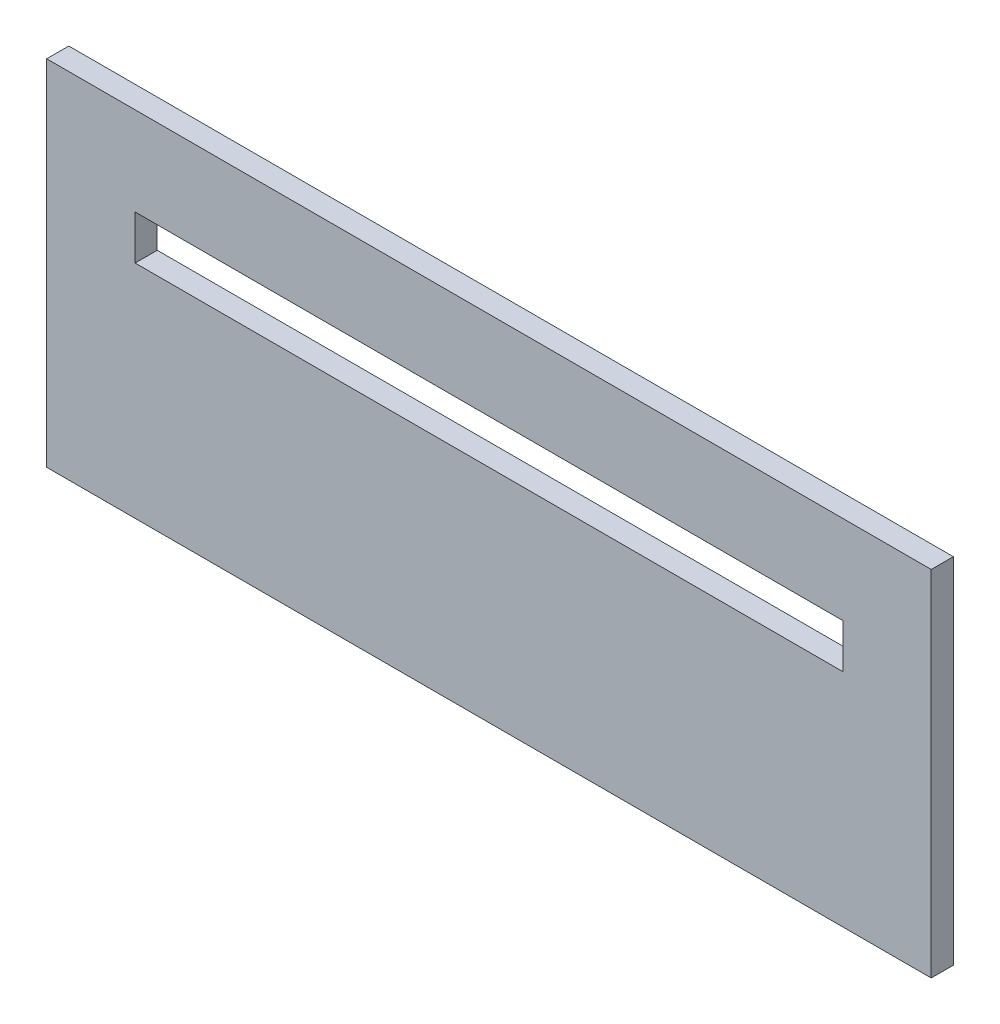
ISO-10303-21;
HEADER;
FILE_DESCRIPTION(('STEP AP214'),'2;1');
FILE_NAME('part.step','',(''),(''),'','','');
FILE_SCHEMA(('AUTOMOTIVE_DESIGN { 1 0 10303 214 1 1 1 1 }'));
ENDSEC;
DATA;
#1=APPLICATION_CONTEXT('core data for automotive mechanical design processes');
#2=APPLICATION_PROTOCOL_DEFINITION('international standard','automotive_design',2000,#1);
#3=PRODUCT_CONTEXT('',#1,'mechanical');
#4=PRODUCT('Part','Part','',(#3));
#5=PRODUCT_RELATED_PRODUCT_CATEGORY('part','',(#4));
#6=PRODUCT_DEFINITION_FORMATION('','',#4);
#7=PRODUCT_DEFINITION_CONTEXT('part definition',#1,'design');
#8=PRODUCT_DEFINITION('design','',#6,#7);
#9=PRODUCT_DEFINITION_SHAPE('','',#8);
#10=(LENGTH_UNIT() NAMED_UNIT(*) SI_UNIT(.MILLI.,.METRE.));
#11=(NAMED_UNIT(*) PLANE_ANGLE_UNIT() SI_UNIT($,.RADIAN.));
#12=(NAMED_UNIT(*) SI_UNIT($,.STERADIAN.) SOLID_ANGLE_UNIT());
#13=UNCERTAINTY_MEASURE_WITH_UNIT(LENGTH_MEASURE(1.E-05),#10,'distance_accuracy_value','');
#14=(GEOMETRIC_REPRESENTATION_CONTEXT(3) GLOBAL_UNCERTAINTY_ASSIGNED_CONTEXT((#13)) GLOBAL_UNIT_ASSIGNED_CONTEXT((#10,
#11,#12)) REPRESENTATION_CONTEXT('',''));
#15=CARTESIAN_POINT('',(0.,0.,0.));
#16=DIRECTION('',(0.,0.,1.));
#17=DIRECTION('',(1.,0.,0.));
#18=AXIS2_PLACEMENT_3D('',#15,#16,#17);
#19=CARTESIAN_POINT('',(97.9550407371005,41.8692483925575,3.175));
#20=DIRECTION('',(-1.,0.,0.));
#21=DIRECTION('',(0.,-1.,0.));
#22=AXIS2_PLACEMENT_3D('',#19,#20,#21);
#23=PLANE('',#22);
#24=DIRECTION('',(0.,1.,0.));
#25=VECTOR('',#24,1.);
#26=CARTESIAN_POINT('',(97.9550407371005,41.8692483925575,0.));
#27=LINE('',#26,#25);
#28=CARTESIAN_POINT('',(97.9550407371005,-8.93075160744255,0.));
#29=VERTEX_POINT('',#28);
#30=CARTESIAN_POINT('',(97.9550407371005,41.8692483925575,0.));
#31=VERTEX_POINT('',#30);
#32=EDGE_CURVE('E130',#29,#31,#27,.T.);
#33=ORIENTED_EDGE('',*,*,#32,.T.);
#34=DIRECTION('',(0.,0.,-1.));
#35=VECTOR('',#34,1.);
#36=CARTESIAN_POINT('',(97.9550407371005,41.8692483925575,3.175));
#37=LINE('',#36,#35);
#38=CARTESIAN_POINT('',(97.9550407371005,41.8692483925575,3.175));
#39=VERTEX_POINT('',#38);
#40=EDGE_CURVE('E11',#39,#31,#37,.T.);
#41=ORIENTED_EDGE('',*,*,#40,.F.);
#42=DIRECTION('',(0.,1.,0.));
#43=VECTOR('',#42,1.);
#44=CARTESIAN_POINT('',(97.9550407371005,41.8692483925575,3.175));
#45=LINE('',#44,#43);
#46=CARTESIAN_POINT('',(97.9550407371005,-8.93075160744255,3.175));
#47=VERTEX_POINT('',#46);
#48=EDGE_CURVE('E134',#47,#39,#45,.T.);
#49=ORIENTED_EDGE('',*,*,#48,.F.);
#50=DIRECTION('',(0.,0.,-1.));
#51=VECTOR('',#50,1.);
#52=CARTESIAN_POINT('',(97.9550407371005,-8.93075160744255,3.175));
#53=LINE('',#52,#51);
#54=EDGE_CURVE('E144',#47,#29,#53,.T.);
#55=ORIENTED_EDGE('',*,*,#54,.T.);
#56=EDGE_LOOP('',(#33,#41,#49,#55));
#57=FACE_BOUND('',#56,.T.);
#58=ADVANCED_FACE('F33',(#57),#23,.F.);
#59=CARTESIAN_POINT('',(97.9550407371005,41.8692483925575,3.175));
#60=DIRECTION('',(0.,-1.,0.));
#61=DIRECTION('',(1.,0.,0.));
#62=AXIS2_PLACEMENT_3D('',#59,#60,#61);
#63=PLANE('',#62);
#64=DIRECTION('',(-1.,0.,0.));
#65=VECTOR('',#64,1.);
#66=CARTESIAN_POINT('',(97.9550407371005,41.8692483925575,0.));
#67=LINE('',#66,#65);
#68=CARTESIAN_POINT('',(-29.0449592628995,41.8692483925574,0.));
#69=VERTEX_POINT('',#68);
#70=EDGE_CURVE('E147',#31,#69,#67,.T.);
#71=ORIENTED_EDGE('',*,*,#70,.T.);
#72=DIRECTION('',(0.,0.,-1.));
#73=VECTOR('',#72,1.);
#74=CARTESIAN_POINT('',(-29.0449592628995,41.8692483925574,3.175));
#75=LINE('',#74,#73);
#76=CARTESIAN_POINT('',(-29.0449592628995,41.8692483925574,3.175));
#77=VERTEX_POINT('',#76);
#78=EDGE_CURVE('E40',#77,#69,#75,.T.);
#79=ORIENTED_EDGE('',*,*,#78,.F.);
#80=DIRECTION('',(-1.,0.,0.));
#81=VECTOR('',#80,1.);
#82=CARTESIAN_POINT('',(97.9550407371005,41.8692483925575,3.175));
#83=LINE('',#82,#81);
#84=EDGE_CURVE('E137',#39,#77,#83,.T.);
#85=ORIENTED_EDGE('',*,*,#84,.F.);
#86=ORIENTED_EDGE('',*,*,#40,.T.);
#87=EDGE_LOOP('',(#71,#79,#85,#86));
#88=FACE_BOUND('',#87,.T.);
#89=ADVANCED_FACE('F175',(#88),#63,.F.);
#90=CARTESIAN_POINT('',(-29.0449592628995,41.8692483925574,3.175));
#91=DIRECTION('',(1.,0.,0.));
#92=DIRECTION('',(0.,1.,0.));
#93=AXIS2_PLACEMENT_3D('',#90,#91,#92);
#94=PLANE('',#93);
#95=DIRECTION('',(0.,-1.,0.));
#96=VECTOR('',#95,1.);
#97=CARTESIAN_POINT('',(-29.0449592628995,41.8692483925574,0.));
#98=LINE('',#97,#96);
#99=CARTESIAN_POINT('',(-29.0449592628995,-8.93075160744257,0.));
#100=VERTEX_POINT('',#99);
#101=EDGE_CURVE('E149',#69,#100,#98,.T.);
#102=ORIENTED_EDGE('',*,*,#101,.T.);
#103=DIRECTION('',(0.,0.,-1.));
#104=VECTOR('',#103,1.);
#105=CARTESIAN_POINT('',(-29.0449592628995,-8.93075160744257,3.175));
#106=LINE('',#105,#104);
#107=CARTESIAN_POINT('',(-29.0449592628995,-8.93075160744257,3.175));
#108=VERTEX_POINT('',#107);
#109=EDGE_CURVE('E154',#108,#100,#106,.T.);
#110=ORIENTED_EDGE('',*,*,#109,.F.);
#111=DIRECTION('',(0.,-1.,0.));
#112=VECTOR('',#111,1.);
#113=CARTESIAN_POINT('',(-29.0449592628995,41.8692483925574,3.175));
#114=LINE('',#113,#112);
#115=EDGE_CURVE('E140',#77,#108,#114,.T.);
#116=ORIENTED_EDGE('',*,*,#115,.F.);
#117=ORIENTED_EDGE('',*,*,#78,.T.);
#118=EDGE_LOOP('',(#102,#110,#116,#117));
#119=FACE_BOUND('',#118,.T.);
#120=ADVANCED_FACE('F161',(#119),#94,.F.);
#121=CARTESIAN_POINT('',(97.9550407371005,-8.93075160744255,3.175));
#122=DIRECTION('',(0.,1.,0.));
#123=DIRECTION('',(-1.,0.,0.));
#124=AXIS2_PLACEMENT_3D('',#121,#122,#123);
#125=PLANE('',#124);
#126=DIRECTION('',(1.,0.,0.));
#127=VECTOR('',#126,1.);
#128=CARTESIAN_POINT('',(97.9550407371005,-8.93075160744255,0.));
#129=LINE('',#128,#127);
#130=EDGE_CURVE('E138',#100,#29,#129,.T.);
#131=ORIENTED_EDGE('',*,*,#130,.T.);
#132=ORIENTED_EDGE('',*,*,#54,.F.);
#133=DIRECTION('',(1.,0.,0.));
#134=VECTOR('',#133,1.);
#135=CARTESIAN_POINT('',(97.9550407371005,-8.93075160744255,3.175));
#136=LINE('',#135,#134);
#137=EDGE_CURVE('E142',#108,#47,#136,.T.);
#138=ORIENTED_EDGE('',*,*,#137,.F.);
#139=ORIENTED_EDGE('',*,*,#109,.T.);
#140=EDGE_LOOP('',(#131,#132,#138,#139));
#141=FACE_BOUND('',#140,.T.);
#142=ADVANCED_FACE('F168',(#141),#125,.F.);
#143=CARTESIAN_POINT('',(0.,0.,3.175));
#144=DIRECTION('',(0.,0.,-1.));
#145=DIRECTION('',(-1.,0.,0.));
#146=AXIS2_PLACEMENT_3D('',#143,#144,#145);
#147=PLANE('',#146);
#148=DIRECTION('',(1.,0.,0.));
#149=VECTOR('',#148,1.);
#150=CARTESIAN_POINT('',(-16.3449592628995,22.8192483925575,3.175));
#151=LINE('',#150,#149);
#152=CARTESIAN_POINT('',(-16.3449592628995,22.8192483925575,3.175));
#153=VERTEX_POINT('',#152);
#154=CARTESIAN_POINT('',(85.2550407371005,22.8192483925575,3.175));
#155=VERTEX_POINT('',#154);
#156=EDGE_CURVE('E124',#153,#155,#151,.T.);
#157=ORIENTED_EDGE('',*,*,#156,.F.);
#158=DIRECTION('',(0.,-1.,0.));
#159=VECTOR('',#158,1.);
#160=CARTESIAN_POINT('',(-16.3449592628995,29.1692483925574,3.175));
#161=LINE('',#160,#159);
#162=CARTESIAN_POINT('',(-16.3449592628995,29.1692483925574,3.175));
#163=VERTEX_POINT('',#162);
#164=EDGE_CURVE('E47',#163,#153,#161,.T.);
#165=ORIENTED_EDGE('',*,*,#164,.F.);
#166=DIRECTION('',(-1.,0.,0.));
#167=VECTOR('',#166,1.);
#168=CARTESIAN_POINT('',(-16.3449592628995,29.1692483925574,3.175));
#169=LINE('',#168,#167);
#170=CARTESIAN_POINT('',(85.2550407371005,29.1692483925574,3.175));
#171=VERTEX_POINT('',#170);
#172=EDGE_CURVE('E115',#171,#163,#169,.T.);
#173=ORIENTED_EDGE('',*,*,#172,.F.);
#174=DIRECTION('',(0.,1.,0.));
#175=VECTOR('',#174,1.);
#176=CARTESIAN_POINT('',(85.2550407371005,29.1692483925574,3.175));
#177=LINE('',#176,#175);
#178=EDGE_CURVE('E118',#155,#171,#177,.T.);
#179=ORIENTED_EDGE('',*,*,#178,.F.);
#180=EDGE_LOOP('',(#157,#165,#173,#179));
#181=FACE_BOUND('',#180,.T.);
#182=ORIENTED_EDGE('',*,*,#48,.T.);
#183=ORIENTED_EDGE('',*,*,#84,.T.);
#184=ORIENTED_EDGE('',*,*,#115,.T.);
#185=ORIENTED_EDGE('',*,*,#137,.T.);
#186=EDGE_LOOP('',(#182,#183,#184,#185));
#187=FACE_BOUND('',#186,.T.);
#188=ADVANCED_FACE('F174',(#181,#187),#147,.F.);
#189=CARTESIAN_POINT('',(0.,0.,0.));
#190=DIRECTION('',(0.,0.,-1.));
#191=DIRECTION('',(-1.,0.,0.));
#192=AXIS2_PLACEMENT_3D('',#189,#190,#191);
#193=PLANE('',#192);
#194=DIRECTION('',(0.,-1.,0.));
#195=VECTOR('',#194,1.);
#196=CARTESIAN_POINT('',(-16.3449592628995,29.1692483925574,0.));
#197=LINE('',#196,#195);
#198=CARTESIAN_POINT('',(-16.3449592628995,29.1692483925574,0.));
#199=VERTEX_POINT('',#198);
#200=CARTESIAN_POINT('',(-16.3449592628995,22.8192483925575,0.));
#201=VERTEX_POINT('',#200);
#202=EDGE_CURVE('E99',#199,#201,#197,.T.);
#203=ORIENTED_EDGE('',*,*,#202,.T.);
#204=DIRECTION('',(1.,0.,0.));
#205=VECTOR('',#204,1.);
#206=CARTESIAN_POINT('',(-16.3449592628995,22.8192483925575,0.));
#207=LINE('',#206,#205);
#208=CARTESIAN_POINT('',(85.2550407371005,22.8192483925575,0.));
#209=VERTEX_POINT('',#208);
#210=EDGE_CURVE('E108',#201,#209,#207,.T.);
#211=ORIENTED_EDGE('',*,*,#210,.T.);
#212=DIRECTION('',(0.,1.,0.));
#213=VECTOR('',#212,1.);
#214=CARTESIAN_POINT('',(85.2550407371005,29.1692483925574,0.));
#215=LINE('',#214,#213);
#216=CARTESIAN_POINT('',(85.2550407371005,29.1692483925574,0.));
#217=VERTEX_POINT('',#216);
#218=EDGE_CURVE('E55',#209,#217,#215,.T.);
#219=ORIENTED_EDGE('',*,*,#218,.T.);
#220=DIRECTION('',(-1.,0.,0.));
#221=VECTOR('',#220,1.);
#222=CARTESIAN_POINT('',(-16.3449592628995,29.1692483925574,0.));
#223=LINE('',#222,#221);
#224=EDGE_CURVE('E105',#217,#199,#223,.T.);
#225=ORIENTED_EDGE('',*,*,#224,.T.);
#226=EDGE_LOOP('',(#203,#211,#219,#225));
#227=FACE_BOUND('',#226,.T.);
#228=ORIENTED_EDGE('',*,*,#32,.F.);
#229=ORIENTED_EDGE('',*,*,#130,.F.);
#230=ORIENTED_EDGE('',*,*,#101,.F.);
#231=ORIENTED_EDGE('',*,*,#70,.F.);
#232=EDGE_LOOP('',(#228,#229,#230,#231));
#233=FACE_BOUND('',#232,.T.);
#234=ADVANCED_FACE('F112',(#227,#233),#193,.T.);
#235=CARTESIAN_POINT('',(-16.3449592628995,29.1692483925574,0.));
#236=DIRECTION('',(-1.,0.,0.));
#237=DIRECTION('',(0.,0.,1.));
#238=AXIS2_PLACEMENT_3D('',#235,#236,#237);
#239=PLANE('',#238);
#240=ORIENTED_EDGE('',*,*,#164,.T.);
#241=DIRECTION('',(0.,0.,1.));
#242=VECTOR('',#241,1.);
#243=CARTESIAN_POINT('',(-16.3449592628995,22.8192483925575,0.));
#244=LINE('',#243,#242);
#245=EDGE_CURVE('E95',#201,#153,#244,.T.);
#246=ORIENTED_EDGE('',*,*,#245,.F.);
#247=ORIENTED_EDGE('',*,*,#202,.F.);
#248=DIRECTION('',(0.,0.,1.));
#249=VECTOR('',#248,1.);
#250=CARTESIAN_POINT('',(-16.3449592628995,29.1692483925574,0.));
#251=LINE('',#250,#249);
#252=EDGE_CURVE('E128',#199,#163,#251,.T.);
#253=ORIENTED_EDGE('',*,*,#252,.T.);
#254=EDGE_LOOP('',(#240,#246,#247,#253));
#255=FACE_BOUND('',#254,.T.);
#256=ADVANCED_FACE('F97',(#255),#239,.F.);
#257=CARTESIAN_POINT('',(-16.3449592628995,29.1692483925574,0.));
#258=DIRECTION('',(0.,1.,0.));
#259=DIRECTION('',(0.,0.,1.));
#260=AXIS2_PLACEMENT_3D('',#257,#258,#259);
#261=PLANE('',#260);
#262=ORIENTED_EDGE('',*,*,#172,.T.);
#263=ORIENTED_EDGE('',*,*,#252,.F.);
#264=ORIENTED_EDGE('',*,*,#224,.F.);
#265=DIRECTION('',(0.,0.,1.));
#266=VECTOR('',#265,1.);
#267=CARTESIAN_POINT('',(85.2550407371005,29.1692483925574,0.));
#268=LINE('',#267,#266);
#269=EDGE_CURVE('E131',#217,#171,#268,.T.);
#270=ORIENTED_EDGE('',*,*,#269,.T.);
#271=EDGE_LOOP('',(#262,#263,#264,#270));
#272=FACE_BOUND('',#271,.T.);
#273=ADVANCED_FACE('F192',(#272),#261,.F.);
#274=CARTESIAN_POINT('',(85.2550407371005,29.1692483925574,0.));
#275=DIRECTION('',(1.,0.,0.));
#276=DIRECTION('',(0.,0.,-1.));
#277=AXIS2_PLACEMENT_3D('',#274,#275,#276);
#278=PLANE('',#277);
#279=ORIENTED_EDGE('',*,*,#178,.T.);
#280=ORIENTED_EDGE('',*,*,#269,.F.);
#281=ORIENTED_EDGE('',*,*,#218,.F.);
#282=DIRECTION('',(0.,0.,1.));
#283=VECTOR('',#282,1.);
#284=CARTESIAN_POINT('',(85.2550407371005,22.8192483925575,0.));
#285=LINE('',#284,#283);
#286=EDGE_CURVE('E104',#209,#155,#285,.T.);
#287=ORIENTED_EDGE('',*,*,#286,.T.);
#288=EDGE_LOOP('',(#279,#280,#281,#287));
#289=FACE_BOUND('',#288,.T.);
#290=ADVANCED_FACE('F195',(#289),#278,.F.);
#291=CARTESIAN_POINT('',(-16.3449592628995,22.8192483925575,0.));
#292=DIRECTION('',(0.,-1.,0.));
#293=DIRECTION('',(0.,0.,-1.));
#294=AXIS2_PLACEMENT_3D('',#291,#292,#293);
#295=PLANE('',#294);
#296=ORIENTED_EDGE('',*,*,#156,.T.);
#297=ORIENTED_EDGE('',*,*,#286,.F.);
#298=ORIENTED_EDGE('',*,*,#210,.F.);
#299=ORIENTED_EDGE('',*,*,#245,.T.);
#300=EDGE_LOOP('',(#296,#297,#298,#299));
#301=FACE_BOUND('',#300,.T.);
#302=ADVANCED_FACE('F109',(#301),#295,.F.);
#303=CLOSED_SHELL('',(#58,#89,#120,#142,#188,#234,#256,#273,#290,#302));
#304=MANIFOLD_SOLID_BREP('B2',#303);
#305=ADVANCED_BREP_SHAPE_REPRESENTATION('',(#18,#304),#14);
#306=SHAPE_DEFINITION_REPRESENTATION(#9,#305);
ENDSEC;
END-ISO-10303-21;
